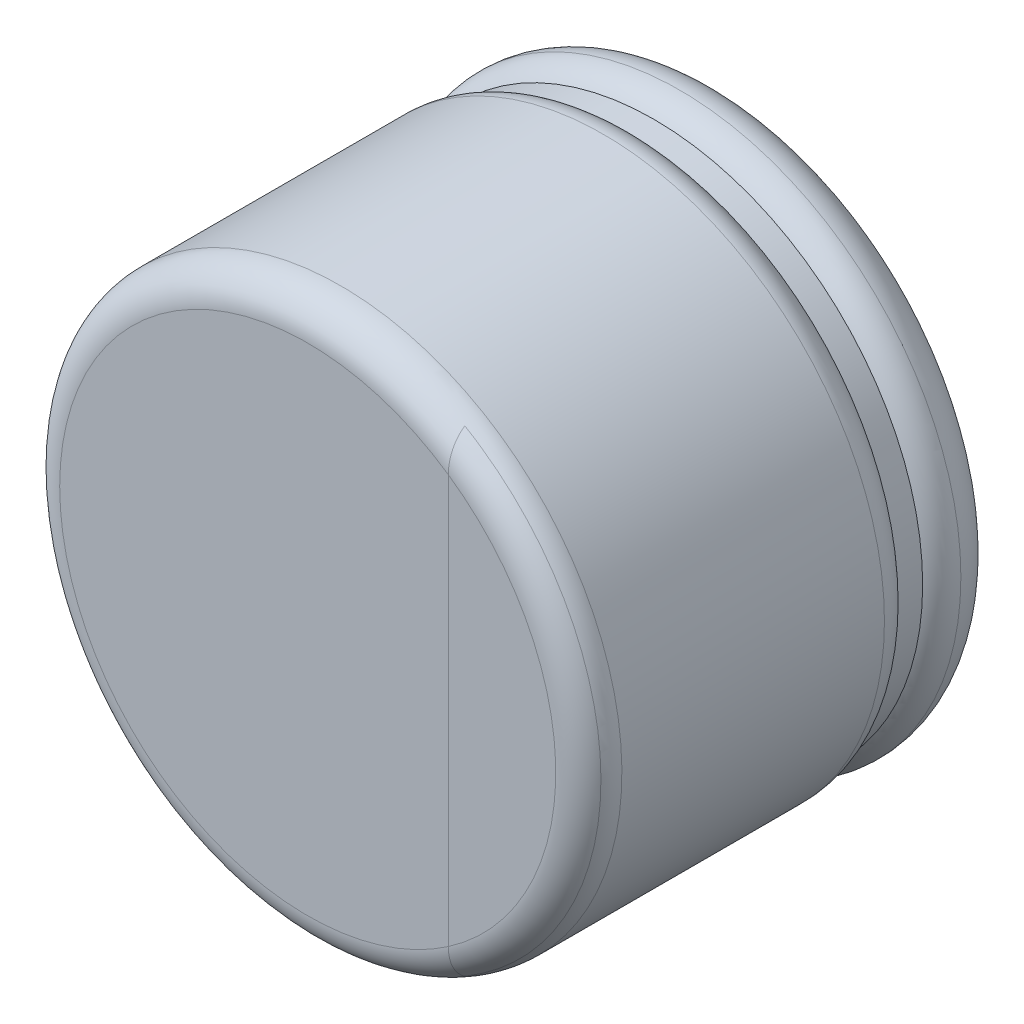
ISO-10303-21;
HEADER;
FILE_DESCRIPTION(('STEP AP214'),'2;1');
FILE_NAME('part.step','',(''),(''),'','','');
FILE_SCHEMA(('AUTOMOTIVE_DESIGN { 1 0 10303 214 1 1 1 1 }'));
ENDSEC;
DATA;
#1=APPLICATION_CONTEXT('core data for automotive mechanical design processes');
#2=APPLICATION_PROTOCOL_DEFINITION('international standard','automotive_design',2000,#1);
#3=PRODUCT_CONTEXT('',#1,'mechanical');
#4=PRODUCT('Part','Part','',(#3));
#5=PRODUCT_RELATED_PRODUCT_CATEGORY('part','',(#4));
#6=PRODUCT_DEFINITION_FORMATION('','',#4);
#7=PRODUCT_DEFINITION_CONTEXT('part definition',#1,'design');
#8=PRODUCT_DEFINITION('design','',#6,#7);
#9=PRODUCT_DEFINITION_SHAPE('','',#8);
#10=(LENGTH_UNIT() NAMED_UNIT(*) SI_UNIT(.MILLI.,.METRE.));
#11=(NAMED_UNIT(*) PLANE_ANGLE_UNIT() SI_UNIT($,.RADIAN.));
#12=(NAMED_UNIT(*) SI_UNIT($,.STERADIAN.) SOLID_ANGLE_UNIT());
#13=UNCERTAINTY_MEASURE_WITH_UNIT(LENGTH_MEASURE(1.E-05),#10,'distance_accuracy_value','');
#14=(GEOMETRIC_REPRESENTATION_CONTEXT(3) GLOBAL_UNCERTAINTY_ASSIGNED_CONTEXT((#13)) GLOBAL_UNIT_ASSIGNED_CONTEXT((#10,
#11,#12)) REPRESENTATION_CONTEXT('',''));
#15=CARTESIAN_POINT('',(0.,0.,0.));
#16=DIRECTION('',(0.,0.,1.));
#17=DIRECTION('',(1.,0.,0.));
#18=AXIS2_PLACEMENT_3D('',#15,#16,#17);
#19=CARTESIAN_POINT('',(2.55,0.,5.1));
#20=DIRECTION('',(0.,0.,-1.));
#21=DIRECTION('',(0.707106781186548,0.707106781186548,0.));
#22=AXIS2_PLACEMENT_3D('',#19,#20,#21);
#23=TOROIDAL_SURFACE('',#22,3.,0.4);
#24=CARTESIAN_POINT('',(2.55,0.,5.3));
#25=DIRECTION('',(0.,0.,-1.));
#26=DIRECTION('',(0.508007063674165,0.861352902855243,0.));
#27=AXIS2_PLACEMENT_3D('',#24,#25,#26);
#28=CIRCLE('',#27,3.34641016151378);
#29=CARTESIAN_POINT('',(4.24999999999645,2.88244010676886,5.29999999999612));
#30=VERTEX_POINT('',#29);
#31=CARTESIAN_POINT('',(4.24999999999645,-2.88244010676886,5.29999999999612));
#32=VERTEX_POINT('',#31);
#33=EDGE_CURVE('E11',#30,#32,#28,.T.);
#34=ORIENTED_EDGE('',*,*,#33,.T.);
#35=CARTESIAN_POINT('',(4.25,-2.47184141886165,5.5));
#36=CARTESIAN_POINT('',(4.25000044056559,-2.48325195031194,5.50000019383558));
#37=CARTESIAN_POINT('',(4.25000813288593,-2.49466316069022,5.49966850945761));
#38=CARTESIAN_POINT('',(4.25002898319711,-2.51712599624003,5.49835085511115));
#39=CARTESIAN_POINT('',(4.25004198163659,-2.52817872050058,5.49738352015754));
#40=CARTESIAN_POINT('',(4.25006505538982,-2.54988758674273,5.49484216171031));
#41=CARTESIAN_POINT('',(4.25007520492684,-2.56054589056308,5.49328666329221));
#42=CARTESIAN_POINT('',(4.25008849042953,-2.58143328252366,5.48961802662067));
#43=CARTESIAN_POINT('',(4.25009182969625,-2.59166558695541,5.487523223949));
#44=CARTESIAN_POINT('',(4.25009046108406,-2.61167329515189,5.48282552241605));
#45=CARTESIAN_POINT('',(4.25008600334453,-2.62145293905744,5.48024070451367));
#46=CARTESIAN_POINT('',(4.25007105647195,-2.64053234189701,5.47461247877806));
#47=CARTESIAN_POINT('',(4.25006076938977,-2.64983733433648,5.47158683648127));
#48=CARTESIAN_POINT('',(4.25003827853379,-2.66794880559085,5.46512618496888));
#49=CARTESIAN_POINT('',(4.25002615168937,-2.67676148394682,5.46170856130267));
#50=CARTESIAN_POINT('',(4.25000776687406,-2.69387454638458,5.45451152841321));
#51=CARTESIAN_POINT('',(4.2500013172868,-2.70218204271919,5.45074909554255));
#52=CARTESIAN_POINT('',(4.2499992224406,-2.71494205665097,5.44453380648601));
#53=CARTESIAN_POINT('',(4.25000005688492,-2.71947219554595,5.44223906398183));
#54=CARTESIAN_POINT('',(4.25000213613493,-2.72841948658607,5.43752797041512));
#55=CARTESIAN_POINT('',(4.25000337736617,-2.73283727401024,5.43511282870223));
#56=CARTESIAN_POINT('',(4.25000647536251,-2.74155625141081,5.43016465821439));
#57=CARTESIAN_POINT('',(4.25000832675324,-2.74585811668165,5.42763281913406));
#58=CARTESIAN_POINT('',(4.25001214063721,-2.75434206874678,5.42245516406548));
#59=CARTESIAN_POINT('',(4.25001410203874,-2.75852486724375,5.41981051475544));
#60=CARTESIAN_POINT('',(4.25001790570399,-2.76676756936964,5.41441120673652));
#61=CARTESIAN_POINT('',(4.25001974884704,-2.77082822042871,5.41165768938353));
#62=CARTESIAN_POINT('',(4.25002309592241,-2.77882367588398,5.40604469646753));
#63=CARTESIAN_POINT('',(4.25002460263275,-2.78275926171093,5.40318633435977));
#64=CARTESIAN_POINT('',(4.25002713296691,-2.79050177608017,5.39736777147104));
#65=CARTESIAN_POINT('',(4.2500281606213,-2.79430951832343,5.39440865376595));
#66=CARTESIAN_POINT('',(4.25002964390019,-2.80179368490569,5.38839276330484));
#67=CARTESIAN_POINT('',(4.25003010433657,-2.80547095319778,5.38533704078994));
#68=CARTESIAN_POINT('',(4.25003042100606,-2.81269166118126,5.37913218127056));
#69=CARTESIAN_POINT('',(4.25003028234252,-2.81623597284078,5.37598405928466));
#70=CARTESIAN_POINT('',(4.25002942116853,-2.82318840869573,5.36959869205161));
#71=CARTESIAN_POINT('',(4.2500287035999,-2.82659743039581,5.36636242429423));
#72=CARTESIAN_POINT('',(4.25002675487575,-2.83327708031039,5.35980510081174));
#73=CARTESIAN_POINT('',(4.25002552807439,-2.83654862885039,5.35648498284842));
#74=CARTESIAN_POINT('',(4.25002267814121,-2.84295128019553,5.34976433251017));
#75=CARTESIAN_POINT('',(4.25002105838283,-2.84608332319397,5.34636469609433));
#76=CARTESIAN_POINT('',(4.25001758362942,-2.85220506542861,5.33948941241727));
#77=CARTESIAN_POINT('',(4.25001573067299,-2.85519572154129,5.33601461740764));
#78=CARTESIAN_POINT('',(4.25001199281304,-2.86103294698447,5.32899345118596));
#79=CARTESIAN_POINT('',(4.25001010828939,-2.86388048646066,5.32544788673312));
#80=CARTESIAN_POINT('',(4.25000654567372,-2.8694298889351,5.31828961443308));
#81=CARTESIAN_POINT('',(4.25000486605678,-2.87213273173313,5.31467766648808));
#82=CARTESIAN_POINT('',(4.25000200004988,-2.87739131064319,5.30739115093538));
#83=CARTESIAN_POINT('',(4.25000080990338,-2.87994803234258,5.30371729445914));
#84=CARTESIAN_POINT('',(4.2499999999929,-2.88244010677041,5.29999999999694));
#85=B_SPLINE_CURVE_WITH_KNOTS('',3,(#35,#36,#37,#38,#39,#40,#41,#42,#43,#44,#45,#46,#47,#48,#49,
#50,#51,#52,#53,#54,#55,#56,#57,#58,#59,#60,#61,#62,#63,#64,#65,#66,#67,#68,#69,#70,#71,#72,#73,
#74,#75,#76,#77,#78,#79,#80,#81,#82,#83,#84),.UNSPECIFIED.,.F.,.F.,(4,2,2,2,2,2,2,2,2,2,2,2,2,2,
2,2,2,2,2,2,2,2,2,2,4),(0.,0.0342277115464558,0.067494250617107,0.0997901601222218,
0.131106958283096,0.16143740642379,0.190775772224485,0.219118091935525,0.246462436025336,
0.261694823811867,0.27679679998488,0.291769160485006,0.30661283263913,0.321328880066928,
0.33591850729447,0.350383064047546,0.364724049196146,0.378943114320274,0.393042066866232,
0.407022872861547,0.420887659156038,0.434638715156067,0.448278494018917,0.461809613274513,
0.475234854842505),.UNSPECIFIED.);
#86=CARTESIAN_POINT('',(4.25,-2.47184141886165,5.5));
#87=VERTEX_POINT('',#86);
#88=EDGE_CURVE('E78',#87,#32,#85,.T.);
#89=ORIENTED_EDGE('',*,*,#88,.F.);
#90=CARTESIAN_POINT('',(2.55,0.,5.5));
#91=DIRECTION('',(0.,0.,-1.));
#92=DIRECTION('',(0.566666666666667,-0.823947139620552,0.));
#93=AXIS2_PLACEMENT_3D('',#90,#91,#92);
#94=CIRCLE('',#93,3.);
#95=CARTESIAN_POINT('',(4.25,2.47184141886166,5.5));
#96=VERTEX_POINT('',#95);
#97=EDGE_CURVE('E28',#87,#96,#94,.T.);
#98=ORIENTED_EDGE('',*,*,#97,.T.);
#99=CARTESIAN_POINT('',(4.25000000000001,2.47184141886166,5.5));
#100=CARTESIAN_POINT('',(4.25000044056561,2.48325195031105,5.50000019383558));
#101=CARTESIAN_POINT('',(4.25000813288595,2.49466316068843,5.49966850945766));
#102=CARTESIAN_POINT('',(4.25002898319717,2.51712599623672,5.4983508551114));
#103=CARTESIAN_POINT('',(4.25004198163667,2.52817872049663,5.49738352015791));
#104=CARTESIAN_POINT('',(4.25006505538997,2.54988758673777,5.49484216171097));
#105=CARTESIAN_POINT('',(4.25007520492704,2.56054589055775,5.49328666329301));
#106=CARTESIAN_POINT('',(4.25008849042981,2.58143328251785,5.48961802662177));
#107=CARTESIAN_POINT('',(4.25009182969657,2.59166558694949,5.48752322395022));
#108=CARTESIAN_POINT('',(4.25009046108444,2.61167329514601,5.48282552241749));
#109=CARTESIAN_POINT('',(4.25008600334495,2.62145293905171,5.48024070451517));
#110=CARTESIAN_POINT('',(4.2500710564724,2.64053234189182,5.47461247877962));
#111=CARTESIAN_POINT('',(4.25006076939021,2.64983733433169,5.47158683648279));
#112=CARTESIAN_POINT('',(4.25003827853421,2.66794880558708,5.46512618497022));
#113=CARTESIAN_POINT('',(4.25002615168975,2.67676148394368,5.46170856130384));
#114=CARTESIAN_POINT('',(4.2500077668743,2.69387454638291,5.4545115284139));
#115=CARTESIAN_POINT('',(4.25000131728693,2.70218204271836,5.45074909554291));
#116=CARTESIAN_POINT('',(4.24999922244054,2.71494205665068,5.44453380648617));
#117=CARTESIAN_POINT('',(4.25000005688478,2.71947219554538,5.44223906398216));
#118=CARTESIAN_POINT('',(4.25000213613467,2.72841948658498,5.43752797041579));
#119=CARTESIAN_POINT('',(4.25000337736586,2.73283727400891,5.43511282870307));
#120=CARTESIAN_POINT('',(4.25000647536212,2.74155625140905,5.43016465821555));
#121=CARTESIAN_POINT('',(4.25000832675281,2.7458581166797,5.42763281913537));
#122=CARTESIAN_POINT('',(4.25001214063672,2.75434206874449,5.42245516406709));
#123=CARTESIAN_POINT('',(4.25001410203823,2.75852486724131,5.4198105147572));
#124=CARTESIAN_POINT('',(4.25001790570344,2.76676756936695,5.41441120673855));
#125=CARTESIAN_POINT('',(4.25001974884648,2.77082822042592,5.41165768938568));
#126=CARTESIAN_POINT('',(4.25002309592185,2.77882367588102,5.4060446964699));
#127=CARTESIAN_POINT('',(4.25002460263218,2.7827592617079,5.40318633436225));
#128=CARTESIAN_POINT('',(4.25002713296635,2.79050177607705,5.39736777147369));
#129=CARTESIAN_POINT('',(4.25002816062075,2.79430951832028,5.39440865376868));
#130=CARTESIAN_POINT('',(4.25002964389967,2.80179368490253,5.3883927633077));
#131=CARTESIAN_POINT('',(4.25003010433606,2.80547095319463,5.38533704079284));
#132=CARTESIAN_POINT('',(4.25003042100559,2.81269166117816,5.37913218127353));
#133=CARTESIAN_POINT('',(4.25003028234208,2.81623597283772,5.37598405928764));
#134=CARTESIAN_POINT('',(4.25002942116814,2.82318840869279,5.36959869205459));
#135=CARTESIAN_POINT('',(4.25002870359953,2.82659743039295,5.36636242429719));
#136=CARTESIAN_POINT('',(4.25002675487543,2.8332770803077,5.35980510081463));
#137=CARTESIAN_POINT('',(4.2500255280741,2.8365486288478,5.35648498285125));
#138=CARTESIAN_POINT('',(4.25002267814098,2.84295128019318,5.34976433251285));
#139=CARTESIAN_POINT('',(4.25002105838263,2.84608332319174,5.34636469609691));
#140=CARTESIAN_POINT('',(4.25001758362927,2.85220506542666,5.33948941241961));
#141=CARTESIAN_POINT('',(4.25001573067286,2.85519572153949,5.33601461740984));
#142=CARTESIAN_POINT('',(4.25001199281296,2.86103294698299,5.32899345118784));
#143=CARTESIAN_POINT('',(4.25001010828933,2.86388048645935,5.32544788673482));
#144=CARTESIAN_POINT('',(4.25000654567369,2.86942988893414,5.31828961443437));
#145=CARTESIAN_POINT('',(4.25000486605677,2.87213273173235,5.31467766648914));
#146=CARTESIAN_POINT('',(4.25000200004989,2.8773913106428,5.30739115093594));
#147=CARTESIAN_POINT('',(4.25000080990339,2.87994803234238,5.30371729445942));
#148=CARTESIAN_POINT('',(4.2499999999929,2.88244010677041,5.29999999999694));
#149=B_SPLINE_CURVE_WITH_KNOTS('',3,(#99,#100,#101,#102,#103,#104,#105,#106,#107,#108,#109,#110,
#111,#112,#113,#114,#115,#116,#117,#118,#119,#120,#121,#122,#123,#124,#125,#126,#127,#128,#129,
#130,#131,#132,#133,#134,#135,#136,#137,#138,#139,#140,#141,#142,#143,#144,#145,#146,#147,#148),
.UNSPECIFIED.,.F.,.F.,(4,2,2,2,2,2,2,2,2,2,2,2,2,2,2,2,2,2,2,2,2,2,2,2,4),(0.,
0.0342277115437718,0.0674942506124976,0.0997901601164435,0.131106958276917,0.161437406417985,
0.19077577221983,0.219118091932799,0.246462436025316,0.261694823810856,0.276796799983006,
0.291769160482401,0.306612832635922,0.321328880063251,0.335918507290457,0.35038306404333,
0.364724049191859,0.378943114316052,0.393042066862211,0.407022872857862,0.420887659152825,
0.434638715153462,0.448278494017058,0.461809613273533,0.475234854842543),.UNSPECIFIED.);
#150=EDGE_CURVE('E77',#96,#30,#149,.T.);
#151=ORIENTED_EDGE('',*,*,#150,.T.);
#152=EDGE_LOOP('',(#34,#89,#98,#151));
#153=FACE_BOUND('',#152,.T.);
#154=CARTESIAN_POINT('',(2.55,0.,5.1));
#155=DIRECTION('',(0.,0.,-1.));
#156=DIRECTION('',(-1.,0.,0.));
#157=AXIS2_PLACEMENT_3D('',#154,#155,#156);
#158=CIRCLE('',#157,3.4);
#159=CARTESIAN_POINT('',(-0.85,0.,5.1));
#160=VERTEX_POINT('',#159);
#161=EDGE_CURVE('E88',#160,#160,#158,.T.);
#162=ORIENTED_EDGE('',*,*,#161,.F.);
#163=EDGE_LOOP('',(#162));
#164=FACE_BOUND('',#163,.T.);
#165=ADVANCED_FACE('F16',(#153,#164),#23,.T.);
#166=CARTESIAN_POINT('',(2.55,0.,5.1));
#167=DIRECTION('',(0.,0.,-1.));
#168=DIRECTION('',(0.707106781186548,0.707106781186548,0.));
#169=AXIS2_PLACEMENT_3D('',#166,#167,#168);
#170=TOROIDAL_SURFACE('',#169,3.,0.4);
#171=ORIENTED_EDGE('',*,*,#33,.F.);
#172=ORIENTED_EDGE('',*,*,#150,.F.);
#173=CARTESIAN_POINT('',(2.55,0.,5.5));
#174=DIRECTION('',(0.,0.,-1.));
#175=DIRECTION('',(0.566666666666666,0.823947139620552,0.));
#176=AXIS2_PLACEMENT_3D('',#173,#174,#175);
#177=CIRCLE('',#176,3.);
#178=EDGE_CURVE('E74',#96,#87,#177,.T.);
#179=ORIENTED_EDGE('',*,*,#178,.T.);
#180=ORIENTED_EDGE('',*,*,#88,.T.);
#181=EDGE_LOOP('',(#171,#172,#179,#180));
#182=FACE_BOUND('',#181,.T.);
#183=ADVANCED_FACE('F97',(#182),#170,.T.);
#184=CARTESIAN_POINT('',(2.55,0.,5.5));
#185=DIRECTION('',(0.,0.,1.));
#186=DIRECTION('',(0.707106781186548,0.707106781186548,0.));
#187=AXIS2_PLACEMENT_3D('',#184,#185,#186);
#188=PLANE('',#187);
#189=DIRECTION('',(0.,-1.,0.));
#190=VECTOR('',#189,1.);
#191=CARTESIAN_POINT('',(4.25,2.47184141886166,5.5));
#192=LINE('',#191,#190);
#193=EDGE_CURVE('E85',#96,#87,#192,.T.);
#194=ORIENTED_EDGE('',*,*,#193,.T.);
#195=ORIENTED_EDGE('',*,*,#178,.F.);
#196=EDGE_LOOP('',(#194,#195));
#197=FACE_BOUND('',#196,.T.);
#198=ADVANCED_FACE('F107',(#197),#188,.T.);
#199=CARTESIAN_POINT('',(2.55,0.,5.5));
#200=DIRECTION('',(0.,0.,1.));
#201=DIRECTION('',(0.707106781186548,0.707106781186548,0.));
#202=AXIS2_PLACEMENT_3D('',#199,#200,#201);
#203=PLANE('',#202);
#204=ORIENTED_EDGE('',*,*,#193,.F.);
#205=ORIENTED_EDGE('',*,*,#97,.F.);
#206=EDGE_LOOP('',(#204,#205));
#207=FACE_BOUND('',#206,.T.);
#208=ADVANCED_FACE('F112',(#207),#203,.T.);
#209=CARTESIAN_POINT('',(2.55,0.,5.1));
#210=DIRECTION('',(0.,0.,-1.));
#211=DIRECTION('',(-1.,0.,0.));
#212=AXIS2_PLACEMENT_3D('',#209,#210,#211);
#213=CYLINDRICAL_SURFACE('',#212,3.4);
#214=ORIENTED_EDGE('',*,*,#161,.T.);
#215=EDGE_LOOP('',(#214));
#216=FACE_BOUND('',#215,.T.);
#217=CARTESIAN_POINT('',(2.55,0.,1.92449979983984));
#218=DIRECTION('',(0.,0.,-1.));
#219=DIRECTION('',(-1.,0.,0.));
#220=AXIS2_PLACEMENT_3D('',#217,#218,#219);
#221=CIRCLE('',#220,3.4);
#222=CARTESIAN_POINT('',(-0.85,0.,1.92449979983984));
#223=VERTEX_POINT('',#222);
#224=EDGE_CURVE('E142',#223,#223,#221,.T.);
#225=ORIENTED_EDGE('',*,*,#224,.F.);
#226=EDGE_LOOP('',(#225));
#227=FACE_BOUND('',#226,.T.);
#228=ADVANCED_FACE('F116',(#216,#227),#213,.T.);
#229=CARTESIAN_POINT('',(2.55,0.,1.92449979983984));
#230=DIRECTION('',(0.,0.,-1.));
#231=DIRECTION('',(0.707106781186548,0.707106781186548,0.));
#232=AXIS2_PLACEMENT_3D('',#229,#230,#231);
#233=TOROIDAL_SURFACE('',#232,3.,0.4);
#234=CARTESIAN_POINT('',(2.55,0.,1.61224989991992));
#235=DIRECTION('',(0.,0.,-1.));
#236=DIRECTION('',(-1.,0.,0.));
#237=AXIS2_PLACEMENT_3D('',#234,#235,#236);
#238=CIRCLE('',#237,3.25);
#239=CARTESIAN_POINT('',(-0.7,0.,1.61224989991992));
#240=VERTEX_POINT('',#239);
#241=EDGE_CURVE('E145',#240,#240,#238,.T.);
#242=ORIENTED_EDGE('',*,*,#241,.F.);
#243=EDGE_LOOP('',(#242));
#244=FACE_BOUND('',#243,.T.);
#245=ORIENTED_EDGE('',*,*,#224,.T.);
#246=EDGE_LOOP('',(#245));
#247=FACE_BOUND('',#246,.T.);
#248=ADVANCED_FACE('F120',(#244,#247),#233,.T.);
#249=CARTESIAN_POINT('',(2.55,0.,1.61224989991992));
#250=DIRECTION('',(0.,0.,-1.));
#251=DIRECTION('',(-1.,0.,0.));
#252=AXIS2_PLACEMENT_3D('',#249,#250,#251);
#253=CYLINDRICAL_SURFACE('',#252,3.25);
#254=ORIENTED_EDGE('',*,*,#241,.T.);
#255=EDGE_LOOP('',(#254));
#256=FACE_BOUND('',#255,.T.);
#257=CARTESIAN_POINT('',(2.55,0.,1.31224989991992));
#258=DIRECTION('',(0.,0.,-1.));
#259=DIRECTION('',(-1.,0.,0.));
#260=AXIS2_PLACEMENT_3D('',#257,#258,#259);
#261=CIRCLE('',#260,3.25);
#262=CARTESIAN_POINT('',(-0.7,0.,1.31224989991992));
#263=VERTEX_POINT('',#262);
#264=EDGE_CURVE('E68',#263,#263,#261,.T.);
#265=ORIENTED_EDGE('',*,*,#264,.F.);
#266=EDGE_LOOP('',(#265));
#267=FACE_BOUND('',#266,.T.);
#268=ADVANCED_FACE('F124',(#256,#267),#253,.T.);
#269=CARTESIAN_POINT('',(2.55,0.,1.));
#270=DIRECTION('',(0.,0.,-1.));
#271=DIRECTION('',(0.707106781186548,0.707106781186548,0.));
#272=AXIS2_PLACEMENT_3D('',#269,#270,#271);
#273=TOROIDAL_SURFACE('',#272,3.,0.4);
#274=ORIENTED_EDGE('',*,*,#264,.T.);
#275=EDGE_LOOP('',(#274));
#276=FACE_BOUND('',#275,.T.);
#277=CARTESIAN_POINT('',(2.55,0.,1.));
#278=DIRECTION('',(0.,0.,-1.));
#279=DIRECTION('',(-1.,0.,0.));
#280=AXIS2_PLACEMENT_3D('',#277,#278,#279);
#281=CIRCLE('',#280,3.4);
#282=CARTESIAN_POINT('',(-0.85,0.,1.));
#283=VERTEX_POINT('',#282);
#284=EDGE_CURVE('E59',#283,#283,#281,.T.);
#285=ORIENTED_EDGE('',*,*,#284,.F.);
#286=EDGE_LOOP('',(#285));
#287=FACE_BOUND('',#286,.T.);
#288=ADVANCED_FACE('F128',(#276,#287),#273,.T.);
#289=CARTESIAN_POINT('',(2.55,0.,1.));
#290=DIRECTION('',(0.,0.,-1.));
#291=DIRECTION('',(0.707106781186548,0.707106781186548,0.));
#292=AXIS2_PLACEMENT_3D('',#289,#290,#291);
#293=TOROIDAL_SURFACE('',#292,2.9,0.5);
#294=CARTESIAN_POINT('',(2.55,0.,0.5));
#295=DIRECTION('',(0.,0.,-1.));
#296=DIRECTION('',(-1.,0.,0.));
#297=AXIS2_PLACEMENT_3D('',#294,#295,#296);
#298=CIRCLE('',#297,2.9);
#299=CARTESIAN_POINT('',(-0.35,0.,0.5));
#300=VERTEX_POINT('',#299);
#301=EDGE_CURVE('E63',#300,#300,#298,.T.);
#302=ORIENTED_EDGE('',*,*,#301,.F.);
#303=EDGE_LOOP('',(#302));
#304=FACE_BOUND('',#303,.T.);
#305=ORIENTED_EDGE('',*,*,#284,.T.);
#306=EDGE_LOOP('',(#305));
#307=FACE_BOUND('',#306,.T.);
#308=ADVANCED_FACE('F64',(#304,#307),#293,.T.);
#309=CARTESIAN_POINT('',(2.55,0.,0.5));
#310=DIRECTION('',(0.,0.,-1.));
#311=DIRECTION('',(0.707106781186548,0.707106781186548,0.));
#312=AXIS2_PLACEMENT_3D('',#309,#310,#311);
#313=PLANE('',#312);
#314=ORIENTED_EDGE('',*,*,#301,.T.);
#315=EDGE_LOOP('',(#314));
#316=FACE_BOUND('',#315,.T.);
#317=ADVANCED_FACE('F18',(#316),#313,.T.);
#318=CLOSED_SHELL('',(#165,#183,#198,#208,#228,#248,#268,#288,#308,#317));
#319=MANIFOLD_SOLID_BREP('B1',#318);
#320=ADVANCED_BREP_SHAPE_REPRESENTATION('',(#18,#319),#14);
#321=SHAPE_DEFINITION_REPRESENTATION(#9,#320);
ENDSEC;
END-ISO-10303-21;
